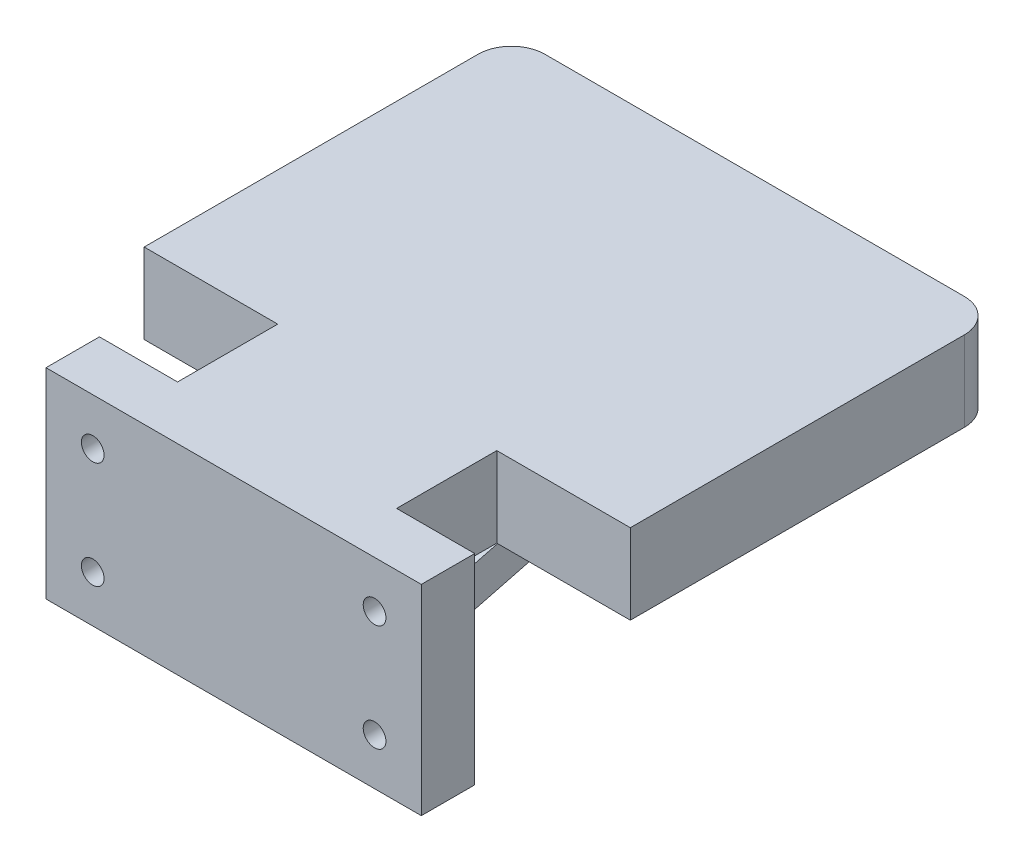
ISO-10303-21;
HEADER;
FILE_DESCRIPTION(('STEP AP214'),'2;1');
FILE_NAME('part.step','',(''),(''),'','','');
FILE_SCHEMA(('AUTOMOTIVE_DESIGN { 1 0 10303 214 1 1 1 1 }'));
ENDSEC;
DATA;
#1=APPLICATION_CONTEXT('core data for automotive mechanical design processes');
#2=APPLICATION_PROTOCOL_DEFINITION('international standard','automotive_design',2000,#1);
#3=PRODUCT_CONTEXT('',#1,'mechanical');
#4=PRODUCT('Part','Part','',(#3));
#5=PRODUCT_RELATED_PRODUCT_CATEGORY('part','',(#4));
#6=PRODUCT_DEFINITION_FORMATION('','',#4);
#7=PRODUCT_DEFINITION_CONTEXT('part definition',#1,'design');
#8=PRODUCT_DEFINITION('design','',#6,#7);
#9=PRODUCT_DEFINITION_SHAPE('','',#8);
#10=(LENGTH_UNIT() NAMED_UNIT(*) SI_UNIT(.MILLI.,.METRE.));
#11=(NAMED_UNIT(*) PLANE_ANGLE_UNIT() SI_UNIT($,.RADIAN.));
#12=(NAMED_UNIT(*) SI_UNIT($,.STERADIAN.) SOLID_ANGLE_UNIT());
#13=UNCERTAINTY_MEASURE_WITH_UNIT(LENGTH_MEASURE(1.E-05),#10,'distance_accuracy_value','');
#14=(GEOMETRIC_REPRESENTATION_CONTEXT(3) GLOBAL_UNCERTAINTY_ASSIGNED_CONTEXT((#13)) GLOBAL_UNIT_ASSIGNED_CONTEXT((#10,
#11,#12)) REPRESENTATION_CONTEXT('',''));
#15=CARTESIAN_POINT('',(0.,0.,0.));
#16=DIRECTION('',(0.,0.,1.));
#17=DIRECTION('',(1.,0.,0.));
#18=AXIS2_PLACEMENT_3D('',#15,#16,#17);
#19=CARTESIAN_POINT('',(49.1999999999998,-7.,12.8083261120685));
#20=DIRECTION('',(0.,0.,-1.));
#21=DIRECTION('',(-1.,0.,0.));
#22=AXIS2_PLACEMENT_3D('',#19,#20,#21);
#23=CYLINDRICAL_SURFACE('',#22,1.7);
#24=CARTESIAN_POINT('',(49.1999999999998,-7.,8.));
#25=DIRECTION('',(0.,0.,-1.));
#26=DIRECTION('',(-1.,0.,0.));
#27=AXIS2_PLACEMENT_3D('',#24,#25,#26);
#28=CIRCLE('',#27,1.7);
#29=CARTESIAN_POINT('',(47.4999999999998,-7.,8.));
#30=VERTEX_POINT('',#29);
#31=EDGE_CURVE('E296',#30,#30,#28,.F.);
#32=ORIENTED_EDGE('',*,*,#31,.T.);
#33=EDGE_LOOP('',(#32));
#34=FACE_BOUND('',#33,.T.);
#35=CARTESIAN_POINT('',(49.1999999999998,-7.,4.));
#36=DIRECTION('',(0.,0.,-1.));
#37=DIRECTION('',(-1.,0.,0.));
#38=AXIS2_PLACEMENT_3D('',#35,#36,#37);
#39=CIRCLE('',#38,1.7);
#40=CARTESIAN_POINT('',(47.4999999999998,-7.,4.));
#41=VERTEX_POINT('',#40);
#42=EDGE_CURVE('E38',#41,#41,#39,.F.);
#43=ORIENTED_EDGE('',*,*,#42,.F.);
#44=EDGE_LOOP('',(#43));
#45=FACE_BOUND('',#44,.T.);
#46=ADVANCED_FACE('F34',(#34,#45),#23,.F.);
#47=CARTESIAN_POINT('',(7.0000000000001,-23.0000000000001,12.8083261120685));
#48=DIRECTION('',(0.,0.,-1.));
#49=DIRECTION('',(-1.,0.,0.));
#50=AXIS2_PLACEMENT_3D('',#47,#48,#49);
#51=CYLINDRICAL_SURFACE('',#50,1.70000000000001);
#52=CARTESIAN_POINT('',(7.0000000000001,-23.0000000000001,8.));
#53=DIRECTION('',(0.,0.,-1.));
#54=DIRECTION('',(-1.,0.,0.));
#55=AXIS2_PLACEMENT_3D('',#52,#53,#54);
#56=CIRCLE('',#55,1.70000000000001);
#57=CARTESIAN_POINT('',(5.3000000000001,-23.0000000000001,8.));
#58=VERTEX_POINT('',#57);
#59=EDGE_CURVE('E297',#58,#58,#56,.F.);
#60=ORIENTED_EDGE('',*,*,#59,.T.);
#61=EDGE_LOOP('',(#60));
#62=FACE_BOUND('',#61,.T.);
#63=CARTESIAN_POINT('',(7.0000000000001,-23.0000000000001,4.));
#64=DIRECTION('',(0.,0.,-1.));
#65=DIRECTION('',(-1.,0.,0.));
#66=AXIS2_PLACEMENT_3D('',#63,#64,#65);
#67=CIRCLE('',#66,1.70000000000001);
#68=CARTESIAN_POINT('',(5.3000000000001,-23.0000000000001,4.));
#69=VERTEX_POINT('',#68);
#70=EDGE_CURVE('E340',#69,#69,#67,.F.);
#71=ORIENTED_EDGE('',*,*,#70,.F.);
#72=EDGE_LOOP('',(#71));
#73=FACE_BOUND('',#72,.T.);
#74=ADVANCED_FACE('F447',(#62,#73),#51,.F.);
#75=CARTESIAN_POINT('',(18.1,0.,0.));
#76=DIRECTION('',(1.,0.,0.));
#77=DIRECTION('',(0.,0.,-1.));
#78=AXIS2_PLACEMENT_3D('',#75,#76,#77);
#79=PLANE('',#78);
#80=DIRECTION('',(0.,1.,0.));
#81=VECTOR('',#80,1.);
#82=CARTESIAN_POINT('',(18.1,-12.,-8.));
#83=LINE('',#82,#81);
#84=CARTESIAN_POINT('',(18.1,-22.,-8.));
#85=VERTEX_POINT('',#84);
#86=CARTESIAN_POINT('',(18.1,-12.,-8.));
#87=VERTEX_POINT('',#86);
#88=EDGE_CURVE('E185',#85,#87,#83,.T.);
#89=ORIENTED_EDGE('',*,*,#88,.F.);
#90=DIRECTION('',(0.,-0.249041039810618,0.96849293259685));
#91=VECTOR('',#90,1.);
#92=CARTESIAN_POINT('',(18.1,-22.,-8.));
#93=LINE('',#92,#91);
#94=CARTESIAN_POINT('',(18.1,-12.,-46.8888888888891));
#95=VERTEX_POINT('',#94);
#96=EDGE_CURVE('E188',#95,#85,#93,.T.);
#97=ORIENTED_EDGE('',*,*,#96,.F.);
#98=DIRECTION('',(0.,0.,1.));
#99=VECTOR('',#98,1.);
#100=CARTESIAN_POINT('',(18.1,-12.,-70.));
#101=LINE('',#100,#99);
#102=CARTESIAN_POINT('',(18.1,-12.,-70.));
#103=VERTEX_POINT('',#102);
#104=EDGE_CURVE('E194',#103,#95,#101,.T.);
#105=ORIENTED_EDGE('',*,*,#104,.F.);
#106=DIRECTION('',(0.,0.249041039810618,-0.96849293259685));
#107=VECTOR('',#106,1.);
#108=CARTESIAN_POINT('',(18.1,-30.,0.));
#109=LINE('',#108,#107);
#110=CARTESIAN_POINT('',(18.1,-30.,0.));
#111=VERTEX_POINT('',#110);
#112=EDGE_CURVE('E204',#111,#103,#109,.T.);
#113=ORIENTED_EDGE('',*,*,#112,.F.);
#114=DIRECTION('',(0.,-1.,0.));
#115=VECTOR('',#114,1.);
#116=CARTESIAN_POINT('',(18.1,-12.,0.));
#117=LINE('',#116,#115);
#118=CARTESIAN_POINT('',(18.1,-12.,0.));
#119=VERTEX_POINT('',#118);
#120=EDGE_CURVE('E193',#119,#111,#117,.T.);
#121=ORIENTED_EDGE('',*,*,#120,.F.);
#122=EDGE_CURVE('E177',#87,#119,#101,.T.);
#123=ORIENTED_EDGE('',*,*,#122,.F.);
#124=EDGE_LOOP('',(#89,#97,#105,#113,#121,#123));
#125=FACE_BOUND('',#124,.T.);
#126=ADVANCED_FACE('F191',(#125),#79,.F.);
#127=CARTESIAN_POINT('',(38.1,0.,0.));
#128=DIRECTION('',(1.,0.,0.));
#129=DIRECTION('',(0.,0.,-1.));
#130=AXIS2_PLACEMENT_3D('',#127,#128,#129);
#131=PLANE('',#130);
#132=DIRECTION('',(0.,0.249041039810618,-0.96849293259685));
#133=VECTOR('',#132,1.);
#134=CARTESIAN_POINT('',(38.1,-22.,-8.));
#135=LINE('',#134,#133);
#136=CARTESIAN_POINT('',(38.1,-22.,-8.));
#137=VERTEX_POINT('',#136);
#138=CARTESIAN_POINT('',(38.1,-12.,-46.888888888889));
#139=VERTEX_POINT('',#138);
#140=EDGE_CURVE('E181',#137,#139,#135,.T.);
#141=ORIENTED_EDGE('',*,*,#140,.F.);
#142=DIRECTION('',(0.,-1.,0.));
#143=VECTOR('',#142,1.);
#144=CARTESIAN_POINT('',(38.1,-12.,-8.));
#145=LINE('',#144,#143);
#146=CARTESIAN_POINT('',(38.1,-12.,-8.));
#147=VERTEX_POINT('',#146);
#148=EDGE_CURVE('E59',#147,#137,#145,.T.);
#149=ORIENTED_EDGE('',*,*,#148,.F.);
#150=DIRECTION('',(0.,0.,1.));
#151=VECTOR('',#150,1.);
#152=CARTESIAN_POINT('',(38.1,-12.,-70.));
#153=LINE('',#152,#151);
#154=CARTESIAN_POINT('',(38.1,-12.,0.));
#155=VERTEX_POINT('',#154);
#156=EDGE_CURVE('E180',#147,#155,#153,.T.);
#157=ORIENTED_EDGE('',*,*,#156,.T.);
#158=DIRECTION('',(0.,-1.,0.));
#159=VECTOR('',#158,1.);
#160=CARTESIAN_POINT('',(38.1,-12.,0.));
#161=LINE('',#160,#159);
#162=CARTESIAN_POINT('',(38.1,-30.,0.));
#163=VERTEX_POINT('',#162);
#164=EDGE_CURVE('E199',#155,#163,#161,.T.);
#165=ORIENTED_EDGE('',*,*,#164,.T.);
#166=DIRECTION('',(0.,0.249041039810618,-0.96849293259685));
#167=VECTOR('',#166,1.);
#168=CARTESIAN_POINT('',(38.1,-30.,0.));
#169=LINE('',#168,#167);
#170=CARTESIAN_POINT('',(38.1,-12.,-70.));
#171=VERTEX_POINT('',#170);
#172=EDGE_CURVE('E195',#163,#171,#169,.T.);
#173=ORIENTED_EDGE('',*,*,#172,.T.);
#174=EDGE_CURVE('E359',#171,#139,#153,.T.);
#175=ORIENTED_EDGE('',*,*,#174,.T.);
#176=EDGE_LOOP('',(#141,#149,#157,#165,#173,#175));
#177=FACE_BOUND('',#176,.T.);
#178=ADVANCED_FACE('F366',(#177),#131,.T.);
#179=CARTESIAN_POINT('',(0.,0.,0.));
#180=DIRECTION('',(0.,0.,1.));
#181=DIRECTION('',(1.,0.,0.));
#182=AXIS2_PLACEMENT_3D('',#179,#180,#181);
#183=PLANE('',#182);
#184=CARTESIAN_POINT('',(7.00000000000003,-23.,0.));
#185=DIRECTION('',(0.,0.,-1.));
#186=DIRECTION('',(-1.,0.,0.));
#187=AXIS2_PLACEMENT_3D('',#184,#185,#186);
#188=CIRCLE('',#187,2.6);
#189=CARTESIAN_POINT('',(4.40000000000004,-23.,0.));
#190=VERTEX_POINT('',#189);
#191=EDGE_CURVE('E538',#190,#190,#188,.T.);
#192=ORIENTED_EDGE('',*,*,#191,.F.);
#193=EDGE_LOOP('',(#192));
#194=FACE_BOUND('',#193,.T.);
#195=CARTESIAN_POINT('',(7.00000000000001,-6.99999999999999,0.));
#196=DIRECTION('',(0.,0.,-1.));
#197=DIRECTION('',(1.,0.,0.));
#198=AXIS2_PLACEMENT_3D('',#195,#196,#197);
#199=CIRCLE('',#198,2.6);
#200=CARTESIAN_POINT('',(9.6,-6.99999999999999,0.));
#201=VERTEX_POINT('',#200);
#202=EDGE_CURVE('E529',#201,#201,#199,.T.);
#203=ORIENTED_EDGE('',*,*,#202,.F.);
#204=EDGE_LOOP('',(#203));
#205=FACE_BOUND('',#204,.T.);
#206=ORIENTED_EDGE('',*,*,#120,.T.);
#207=DIRECTION('',(1.,0.,0.));
#208=VECTOR('',#207,1.);
#209=CARTESIAN_POINT('',(-2.08166817117217E-13,-30.,0.));
#210=LINE('',#209,#208);
#211=CARTESIAN_POINT('',(-2.08166817117217E-13,-30.,0.));
#212=VERTEX_POINT('',#211);
#213=EDGE_CURVE('E326',#212,#111,#210,.T.);
#214=ORIENTED_EDGE('',*,*,#213,.F.);
#215=DIRECTION('',(0.,-1.,0.));
#216=VECTOR('',#215,1.);
#217=CARTESIAN_POINT('',(0.,0.,0.));
#218=LINE('',#217,#216);
#219=CARTESIAN_POINT('',(0.,0.,0.));
#220=VERTEX_POINT('',#219);
#221=EDGE_CURVE('E323',#220,#212,#218,.T.);
#222=ORIENTED_EDGE('',*,*,#221,.F.);
#223=DIRECTION('',(-1.,0.,0.));
#224=VECTOR('',#223,1.);
#225=CARTESIAN_POINT('',(0.,0.,0.));
#226=LINE('',#225,#224);
#227=CARTESIAN_POINT('',(11.7,0.,0.));
#228=VERTEX_POINT('',#227);
#229=EDGE_CURVE('E319',#228,#220,#226,.T.);
#230=ORIENTED_EDGE('',*,*,#229,.F.);
#231=DIRECTION('',(0.,1.,0.));
#232=VECTOR('',#231,1.);
#233=CARTESIAN_POINT('',(11.7,-12.,0.));
#234=LINE('',#233,#232);
#235=CARTESIAN_POINT('',(11.7,-12.,0.));
#236=VERTEX_POINT('',#235);
#237=EDGE_CURVE('E246',#236,#228,#234,.T.);
#238=ORIENTED_EDGE('',*,*,#237,.F.);
#239=DIRECTION('',(1.,0.,0.));
#240=VECTOR('',#239,1.);
#241=CARTESIAN_POINT('',(44.4999999999998,-12.,0.));
#242=LINE('',#241,#240);
#243=EDGE_CURVE('E219',#236,#119,#242,.T.);
#244=ORIENTED_EDGE('',*,*,#243,.T.);
#245=EDGE_LOOP('',(#206,#214,#222,#230,#238,#244));
#246=FACE_BOUND('',#245,.T.);
#247=ADVANCED_FACE('F414',(#194,#205,#246),#183,.F.);
#248=CARTESIAN_POINT('',(49.1999999999998,-23.,0.));
#249=DIRECTION('',(0.,0.,-1.));
#250=DIRECTION('',(1.,0.,0.));
#251=AXIS2_PLACEMENT_3D('',#248,#249,#250);
#252=CIRCLE('',#251,2.59999999999999);
#253=CARTESIAN_POINT('',(51.7999999999998,-23.,0.));
#254=VERTEX_POINT('',#253);
#255=EDGE_CURVE('E544',#254,#254,#252,.T.);
#256=ORIENTED_EDGE('',*,*,#255,.F.);
#257=EDGE_LOOP('',(#256));
#258=FACE_BOUND('',#257,.T.);
#259=CARTESIAN_POINT('',(49.1999999999998,-7.,0.));
#260=DIRECTION('',(0.,0.,-1.));
#261=DIRECTION('',(-1.,0.,0.));
#262=AXIS2_PLACEMENT_3D('',#259,#260,#261);
#263=CIRCLE('',#262,2.6);
#264=CARTESIAN_POINT('',(46.5999999999998,-7.,0.));
#265=VERTEX_POINT('',#264);
#266=EDGE_CURVE('E352',#265,#265,#263,.T.);
#267=ORIENTED_EDGE('',*,*,#266,.F.);
#268=EDGE_LOOP('',(#267));
#269=FACE_BOUND('',#268,.T.);
#270=CARTESIAN_POINT('',(56.2,-30.,0.));
#271=VERTEX_POINT('',#270);
#272=EDGE_CURVE('E325',#163,#271,#210,.T.);
#273=ORIENTED_EDGE('',*,*,#272,.F.);
#274=ORIENTED_EDGE('',*,*,#164,.F.);
#275=CARTESIAN_POINT('',(44.4999999999998,-12.,0.));
#276=VERTEX_POINT('',#275);
#277=EDGE_CURVE('E217',#155,#276,#242,.T.);
#278=ORIENTED_EDGE('',*,*,#277,.T.);
#279=DIRECTION('',(0.,1.,0.));
#280=VECTOR('',#279,1.);
#281=CARTESIAN_POINT('',(44.4999999999998,-12.,0.));
#282=LINE('',#281,#280);
#283=CARTESIAN_POINT('',(44.4999999999998,0.,0.));
#284=VERTEX_POINT('',#283);
#285=EDGE_CURVE('E289',#276,#284,#282,.T.);
#286=ORIENTED_EDGE('',*,*,#285,.T.);
#287=CARTESIAN_POINT('',(56.1999999999998,0.,0.));
#288=VERTEX_POINT('',#287);
#289=EDGE_CURVE('E320',#288,#284,#226,.T.);
#290=ORIENTED_EDGE('',*,*,#289,.F.);
#291=DIRECTION('',(0.,1.,0.));
#292=VECTOR('',#291,1.);
#293=CARTESIAN_POINT('',(56.1999999999998,0.,0.));
#294=LINE('',#293,#292);
#295=EDGE_CURVE('E316',#271,#288,#294,.T.);
#296=ORIENTED_EDGE('',*,*,#295,.F.);
#297=EDGE_LOOP('',(#273,#274,#278,#286,#290,#296));
#298=FACE_BOUND('',#297,.T.);
#299=ADVANCED_FACE('F403',(#258,#269,#298),#183,.F.);
#300=CARTESIAN_POINT('',(56.1999999999998,0.,5.));
#301=DIRECTION('',(-1.,0.,0.));
#302=DIRECTION('',(0.,-1.,0.));
#303=AXIS2_PLACEMENT_3D('',#300,#301,#302);
#304=PLANE('',#303);
#305=ORIENTED_EDGE('',*,*,#295,.T.);
#306=DIRECTION('',(0.,0.,-1.));
#307=VECTOR('',#306,1.);
#308=CARTESIAN_POINT('',(56.1999999999998,0.,5.));
#309=LINE('',#308,#307);
#310=CARTESIAN_POINT('',(56.1999999999998,0.,8.));
#311=VERTEX_POINT('',#310);
#312=EDGE_CURVE('E11',#311,#288,#309,.T.);
#313=ORIENTED_EDGE('',*,*,#312,.F.);
#314=DIRECTION('',(0.,1.,0.));
#315=VECTOR('',#314,1.);
#316=CARTESIAN_POINT('',(56.1999999999998,0.,8.));
#317=LINE('',#316,#315);
#318=CARTESIAN_POINT('',(56.2,-29.9999999999996,8.));
#319=VERTEX_POINT('',#318);
#320=EDGE_CURVE('E313',#319,#311,#317,.T.);
#321=ORIENTED_EDGE('',*,*,#320,.F.);
#322=DIRECTION('',(0.,0.,-1.));
#323=VECTOR('',#322,1.);
#324=CARTESIAN_POINT('',(56.2,-30.,5.));
#325=LINE('',#324,#323);
#326=EDGE_CURVE('E329',#319,#271,#325,.T.);
#327=ORIENTED_EDGE('',*,*,#326,.T.);
#328=EDGE_LOOP('',(#305,#313,#321,#327));
#329=FACE_BOUND('',#328,.T.);
#330=ADVANCED_FACE('F36',(#329),#304,.F.);
#331=CARTESIAN_POINT('',(0.,0.,5.));
#332=DIRECTION('',(0.,-1.,0.));
#333=DIRECTION('',(1.,0.,0.));
#334=AXIS2_PLACEMENT_3D('',#331,#332,#333);
#335=PLANE('',#334);
#336=ORIENTED_EDGE('',*,*,#289,.T.);
#337=DIRECTION('',(0.,0.,-1.));
#338=VECTOR('',#337,1.);
#339=CARTESIAN_POINT('',(44.4999999999998,0.,0.));
#340=LINE('',#339,#338);
#341=CARTESIAN_POINT('',(44.4999999999998,0.,-15.));
#342=VERTEX_POINT('',#341);
#343=EDGE_CURVE('E249',#284,#342,#340,.T.);
#344=ORIENTED_EDGE('',*,*,#343,.T.);
#345=DIRECTION('',(1.,0.,0.));
#346=VECTOR('',#345,1.);
#347=CARTESIAN_POINT('',(44.4999999999998,0.,-15.));
#348=LINE('',#347,#346);
#349=CARTESIAN_POINT('',(64.4999999999998,0.,-15.));
#350=VERTEX_POINT('',#349);
#351=EDGE_CURVE('E252',#342,#350,#348,.T.);
#352=ORIENTED_EDGE('',*,*,#351,.T.);
#353=DIRECTION('',(0.,0.,-1.));
#354=VECTOR('',#353,1.);
#355=CARTESIAN_POINT('',(64.4999999999998,0.,-15.));
#356=LINE('',#355,#354);
#357=CARTESIAN_POINT('',(64.4999999999998,0.,-65.));
#358=VERTEX_POINT('',#357);
#359=EDGE_CURVE('E255',#350,#358,#356,.T.);
#360=ORIENTED_EDGE('',*,*,#359,.T.);
#361=CARTESIAN_POINT('',(59.4999999999998,0.,-65.));
#362=DIRECTION('',(0.,1.,0.));
#363=DIRECTION('',(0.,0.,1.));
#364=AXIS2_PLACEMENT_3D('',#361,#362,#363);
#365=CIRCLE('',#364,5.);
#366=CARTESIAN_POINT('',(59.4999999999998,0.,-70.));
#367=VERTEX_POINT('',#366);
#368=EDGE_CURVE('E258',#358,#367,#365,.T.);
#369=ORIENTED_EDGE('',*,*,#368,.T.);
#370=DIRECTION('',(-1.,0.,0.));
#371=VECTOR('',#370,1.);
#372=CARTESIAN_POINT('',(-3.3,0.,-70.));
#373=LINE('',#372,#371);
#374=CARTESIAN_POINT('',(-3.3,0.,-70.));
#375=VERTEX_POINT('',#374);
#376=EDGE_CURVE('E261',#367,#375,#373,.T.);
#377=ORIENTED_EDGE('',*,*,#376,.T.);
#378=CARTESIAN_POINT('',(-3.3,0.,-65.));
#379=DIRECTION('',(0.,1.,0.));
#380=DIRECTION('',(0.,0.,-1.));
#381=AXIS2_PLACEMENT_3D('',#378,#379,#380);
#382=CIRCLE('',#381,5.);
#383=CARTESIAN_POINT('',(-8.3,0.,-65.));
#384=VERTEX_POINT('',#383);
#385=EDGE_CURVE('E264',#375,#384,#382,.T.);
#386=ORIENTED_EDGE('',*,*,#385,.T.);
#387=DIRECTION('',(0.,0.,1.));
#388=VECTOR('',#387,1.);
#389=CARTESIAN_POINT('',(-8.3,0.,-15.));
#390=LINE('',#389,#388);
#391=CARTESIAN_POINT('',(-8.3,0.,-15.));
#392=VERTEX_POINT('',#391);
#393=EDGE_CURVE('E267',#384,#392,#390,.T.);
#394=ORIENTED_EDGE('',*,*,#393,.T.);
#395=DIRECTION('',(1.,0.,0.));
#396=VECTOR('',#395,1.);
#397=CARTESIAN_POINT('',(11.7,0.,-15.));
#398=LINE('',#397,#396);
#399=CARTESIAN_POINT('',(11.7,0.,-15.));
#400=VERTEX_POINT('',#399);
#401=EDGE_CURVE('E218',#392,#400,#398,.T.);
#402=ORIENTED_EDGE('',*,*,#401,.T.);
#403=DIRECTION('',(0.,0.,1.));
#404=VECTOR('',#403,1.);
#405=CARTESIAN_POINT('',(11.7,0.,0.));
#406=LINE('',#405,#404);
#407=EDGE_CURVE('E211',#400,#228,#406,.T.);
#408=ORIENTED_EDGE('',*,*,#407,.T.);
#409=ORIENTED_EDGE('',*,*,#229,.T.);
#410=DIRECTION('',(0.,0.,-1.));
#411=VECTOR('',#410,1.);
#412=CARTESIAN_POINT('',(0.,0.,5.));
#413=LINE('',#412,#411);
#414=CARTESIAN_POINT('',(0.,0.,8.));
#415=VERTEX_POINT('',#414);
#416=EDGE_CURVE('E43',#415,#220,#413,.T.);
#417=ORIENTED_EDGE('',*,*,#416,.F.);
#418=DIRECTION('',(-1.,0.,0.));
#419=VECTOR('',#418,1.);
#420=CARTESIAN_POINT('',(0.,0.,8.));
#421=LINE('',#420,#419);
#422=EDGE_CURVE('E304',#311,#415,#421,.T.);
#423=ORIENTED_EDGE('',*,*,#422,.F.);
#424=ORIENTED_EDGE('',*,*,#312,.T.);
#425=EDGE_LOOP('',(#336,#344,#352,#360,#369,#377,#386,#394,#402,#408,#409,#417,#423,#424));
#426=FACE_BOUND('',#425,.T.);
#427=ADVANCED_FACE('F387',(#426),#335,.F.);
#428=CARTESIAN_POINT('',(0.,0.,5.));
#429=DIRECTION('',(1.,0.,0.));
#430=DIRECTION('',(0.,1.,0.));
#431=AXIS2_PLACEMENT_3D('',#428,#429,#430);
#432=PLANE('',#431);
#433=ORIENTED_EDGE('',*,*,#221,.T.);
#434=DIRECTION('',(0.,0.,-1.));
#435=VECTOR('',#434,1.);
#436=CARTESIAN_POINT('',(-2.08166817117217E-13,-30.,5.));
#437=LINE('',#436,#435);
#438=CARTESIAN_POINT('',(-2.08166817117217E-13,-30.,8.));
#439=VERTEX_POINT('',#438);
#440=EDGE_CURVE('E332',#439,#212,#437,.T.);
#441=ORIENTED_EDGE('',*,*,#440,.F.);
#442=DIRECTION('',(0.,-1.,0.));
#443=VECTOR('',#442,1.);
#444=CARTESIAN_POINT('',(0.,0.,8.));
#445=LINE('',#444,#443);
#446=EDGE_CURVE('E307',#415,#439,#445,.T.);
#447=ORIENTED_EDGE('',*,*,#446,.F.);
#448=ORIENTED_EDGE('',*,*,#416,.T.);
#449=EDGE_LOOP('',(#433,#441,#447,#448));
#450=FACE_BOUND('',#449,.T.);
#451=ADVANCED_FACE('F428',(#450),#432,.F.);
#452=CARTESIAN_POINT('',(-2.08166817117217E-13,-30.,5.));
#453=DIRECTION('',(0.,1.,0.));
#454=DIRECTION('',(-1.,0.,0.));
#455=AXIS2_PLACEMENT_3D('',#452,#453,#454);
#456=PLANE('',#455);
#457=ORIENTED_EDGE('',*,*,#213,.T.);
#458=DIRECTION('',(1.,0.,0.));
#459=VECTOR('',#458,1.);
#460=CARTESIAN_POINT('',(18.1,-30.,0.));
#461=LINE('',#460,#459);
#462=EDGE_CURVE('E207',#111,#163,#461,.T.);
#463=ORIENTED_EDGE('',*,*,#462,.T.);
#464=ORIENTED_EDGE('',*,*,#272,.T.);
#465=ORIENTED_EDGE('',*,*,#326,.F.);
#466=DIRECTION('',(1.,0.,0.));
#467=VECTOR('',#466,1.);
#468=CARTESIAN_POINT('',(-2.08166817117217E-13,-30.,8.));
#469=LINE('',#468,#467);
#470=EDGE_CURVE('E310',#439,#319,#469,.T.);
#471=ORIENTED_EDGE('',*,*,#470,.F.);
#472=ORIENTED_EDGE('',*,*,#440,.T.);
#473=EDGE_LOOP('',(#457,#463,#464,#465,#471,#472));
#474=FACE_BOUND('',#473,.T.);
#475=ADVANCED_FACE('F409',(#474),#456,.F.);
#476=CARTESIAN_POINT('',(0.,0.,8.));
#477=DIRECTION('',(0.,0.,-1.));
#478=DIRECTION('',(-1.,0.,0.));
#479=AXIS2_PLACEMENT_3D('',#476,#477,#478);
#480=PLANE('',#479);
#481=CARTESIAN_POINT('',(7.00000000000008,-6.99999999999992,8.));
#482=DIRECTION('',(0.,0.,-1.));
#483=DIRECTION('',(-1.,0.,0.));
#484=AXIS2_PLACEMENT_3D('',#481,#482,#483);
#485=CIRCLE('',#484,1.7);
#486=CARTESIAN_POINT('',(5.30000000000007,-6.99999999999992,8.));
#487=VERTEX_POINT('',#486);
#488=EDGE_CURVE('E293',#487,#487,#485,.F.);
#489=ORIENTED_EDGE('',*,*,#488,.F.);
#490=EDGE_LOOP('',(#489));
#491=FACE_BOUND('',#490,.T.);
#492=ORIENTED_EDGE('',*,*,#59,.F.);
#493=EDGE_LOOP('',(#492));
#494=FACE_BOUND('',#493,.T.);
#495=CARTESIAN_POINT('',(49.1999999999998,-23.,8.));
#496=DIRECTION('',(0.,0.,-1.));
#497=DIRECTION('',(-1.,0.,0.));
#498=AXIS2_PLACEMENT_3D('',#495,#496,#497);
#499=CIRCLE('',#498,1.69999999999999);
#500=CARTESIAN_POINT('',(47.4999999999998,-23.,8.));
#501=VERTEX_POINT('',#500);
#502=EDGE_CURVE('E274',#501,#501,#499,.F.);
#503=ORIENTED_EDGE('',*,*,#502,.F.);
#504=EDGE_LOOP('',(#503));
#505=FACE_BOUND('',#504,.T.);
#506=ORIENTED_EDGE('',*,*,#31,.F.);
#507=EDGE_LOOP('',(#506));
#508=FACE_BOUND('',#507,.T.);
#509=ORIENTED_EDGE('',*,*,#422,.T.);
#510=ORIENTED_EDGE('',*,*,#446,.T.);
#511=ORIENTED_EDGE('',*,*,#470,.T.);
#512=ORIENTED_EDGE('',*,*,#320,.T.);
#513=EDGE_LOOP('',(#509,#510,#511,#512));
#514=FACE_BOUND('',#513,.T.);
#515=ADVANCED_FACE('F430',(#491,#494,#505,#508,#514),#480,.F.);
#516=CARTESIAN_POINT('',(49.1999999999998,-23.,12.8083261120685));
#517=DIRECTION('',(0.,0.,-1.));
#518=DIRECTION('',(-1.,0.,0.));
#519=AXIS2_PLACEMENT_3D('',#516,#517,#518);
#520=CYLINDRICAL_SURFACE('',#519,1.69999999999999);
#521=CARTESIAN_POINT('',(49.1999999999998,-23.,4.));
#522=DIRECTION('',(0.,0.,1.));
#523=DIRECTION('',(1.,0.,0.));
#524=AXIS2_PLACEMENT_3D('',#521,#522,#523);
#525=CIRCLE('',#524,1.69999999999999);
#526=CARTESIAN_POINT('',(50.8999999999998,-23.,4.));
#527=VERTEX_POINT('',#526);
#528=EDGE_CURVE('E343',#527,#527,#525,.F.);
#529=ORIENTED_EDGE('',*,*,#528,.T.);
#530=EDGE_LOOP('',(#529));
#531=FACE_BOUND('',#530,.T.);
#532=ORIENTED_EDGE('',*,*,#502,.T.);
#533=EDGE_LOOP('',(#532));
#534=FACE_BOUND('',#533,.T.);
#535=ADVANCED_FACE('F432',(#531,#534),#520,.F.);
#536=CARTESIAN_POINT('',(7.00000000000008,-6.99999999999992,12.8083261120685));
#537=DIRECTION('',(0.,0.,-1.));
#538=DIRECTION('',(-1.,0.,0.));
#539=AXIS2_PLACEMENT_3D('',#536,#537,#538);
#540=CYLINDRICAL_SURFACE('',#539,1.7);
#541=CARTESIAN_POINT('',(7.00000000000008,-6.99999999999992,4.));
#542=DIRECTION('',(0.,0.,1.));
#543=DIRECTION('',(1.,0.,0.));
#544=AXIS2_PLACEMENT_3D('',#541,#542,#543);
#545=CIRCLE('',#544,1.7);
#546=CARTESIAN_POINT('',(8.70000000000008,-6.99999999999992,4.));
#547=VERTEX_POINT('',#546);
#548=EDGE_CURVE('E337',#547,#547,#545,.F.);
#549=ORIENTED_EDGE('',*,*,#548,.T.);
#550=EDGE_LOOP('',(#549));
#551=FACE_BOUND('',#550,.T.);
#552=ORIENTED_EDGE('',*,*,#488,.T.);
#553=EDGE_LOOP('',(#552));
#554=FACE_BOUND('',#553,.T.);
#555=ADVANCED_FACE('F439',(#551,#554),#540,.F.);
#556=CARTESIAN_POINT('',(11.7,-12.,0.));
#557=DIRECTION('',(-1.,0.,0.));
#558=DIRECTION('',(0.,0.,1.));
#559=AXIS2_PLACEMENT_3D('',#556,#557,#558);
#560=PLANE('',#559);
#561=ORIENTED_EDGE('',*,*,#407,.F.);
#562=DIRECTION('',(0.,1.,0.));
#563=VECTOR('',#562,1.);
#564=CARTESIAN_POINT('',(11.7,-12.,-15.));
#565=LINE('',#564,#563);
#566=CARTESIAN_POINT('',(11.7,-12.,-15.));
#567=VERTEX_POINT('',#566);
#568=EDGE_CURVE('E272',#567,#400,#565,.T.);
#569=ORIENTED_EDGE('',*,*,#568,.F.);
#570=DIRECTION('',(0.,0.,1.));
#571=VECTOR('',#570,1.);
#572=CARTESIAN_POINT('',(11.7,-12.,0.));
#573=LINE('',#572,#571);
#574=EDGE_CURVE('E214',#567,#236,#573,.T.);
#575=ORIENTED_EDGE('',*,*,#574,.T.);
#576=ORIENTED_EDGE('',*,*,#237,.T.);
#577=EDGE_LOOP('',(#561,#569,#575,#576));
#578=FACE_BOUND('',#577,.T.);
#579=ADVANCED_FACE('F420',(#578),#560,.T.);
#580=CARTESIAN_POINT('',(11.7,-12.,-15.));
#581=DIRECTION('',(0.,0.,1.));
#582=DIRECTION('',(1.,0.,0.));
#583=AXIS2_PLACEMENT_3D('',#580,#581,#582);
#584=PLANE('',#583);
#585=ORIENTED_EDGE('',*,*,#401,.F.);
#586=DIRECTION('',(0.,1.,0.));
#587=VECTOR('',#586,1.);
#588=CARTESIAN_POINT('',(-8.3,-12.,-15.));
#589=LINE('',#588,#587);
#590=CARTESIAN_POINT('',(-8.3,-12.,-15.));
#591=VERTEX_POINT('',#590);
#592=EDGE_CURVE('E275',#591,#392,#589,.T.);
#593=ORIENTED_EDGE('',*,*,#592,.F.);
#594=DIRECTION('',(1.,0.,0.));
#595=VECTOR('',#594,1.);
#596=CARTESIAN_POINT('',(11.7,-12.,-15.));
#597=LINE('',#596,#595);
#598=EDGE_CURVE('E243',#591,#567,#597,.T.);
#599=ORIENTED_EDGE('',*,*,#598,.T.);
#600=ORIENTED_EDGE('',*,*,#568,.T.);
#601=EDGE_LOOP('',(#585,#593,#599,#600));
#602=FACE_BOUND('',#601,.T.);
#603=ADVANCED_FACE('F423',(#602),#584,.T.);
#604=CARTESIAN_POINT('',(-8.3,-12.,-15.));
#605=DIRECTION('',(-1.,0.,0.));
#606=DIRECTION('',(0.,0.,1.));
#607=AXIS2_PLACEMENT_3D('',#604,#605,#606);
#608=PLANE('',#607);
#609=ORIENTED_EDGE('',*,*,#393,.F.);
#610=DIRECTION('',(0.,1.,0.));
#611=VECTOR('',#610,1.);
#612=CARTESIAN_POINT('',(-8.3,-12.,-65.));
#613=LINE('',#612,#611);
#614=CARTESIAN_POINT('',(-8.3,-12.,-65.));
#615=VERTEX_POINT('',#614);
#616=EDGE_CURVE('E277',#615,#384,#613,.T.);
#617=ORIENTED_EDGE('',*,*,#616,.F.);
#618=DIRECTION('',(0.,0.,1.));
#619=VECTOR('',#618,1.);
#620=CARTESIAN_POINT('',(-8.3,-12.,-15.));
#621=LINE('',#620,#619);
#622=EDGE_CURVE('E240',#615,#591,#621,.T.);
#623=ORIENTED_EDGE('',*,*,#622,.T.);
#624=ORIENTED_EDGE('',*,*,#592,.T.);
#625=EDGE_LOOP('',(#609,#617,#623,#624));
#626=FACE_BOUND('',#625,.T.);
#627=ADVANCED_FACE('F425',(#626),#608,.T.);
#628=CARTESIAN_POINT('',(-3.3,-12.,-65.));
#629=DIRECTION('',(0.,1.,0.));
#630=DIRECTION('',(0.,0.,1.));
#631=AXIS2_PLACEMENT_3D('',#628,#629,#630);
#632=CYLINDRICAL_SURFACE('',#631,5.);
#633=ORIENTED_EDGE('',*,*,#385,.F.);
#634=DIRECTION('',(0.,1.,0.));
#635=VECTOR('',#634,1.);
#636=CARTESIAN_POINT('',(-3.3,-12.,-70.));
#637=LINE('',#636,#635);
#638=CARTESIAN_POINT('',(-3.3,-12.,-70.));
#639=VERTEX_POINT('',#638);
#640=EDGE_CURVE('E279',#639,#375,#637,.T.);
#641=ORIENTED_EDGE('',*,*,#640,.F.);
#642=CARTESIAN_POINT('',(-3.3,-12.,-65.));
#643=DIRECTION('',(0.,1.,0.));
#644=DIRECTION('',(0.,0.,-1.));
#645=AXIS2_PLACEMENT_3D('',#642,#643,#644);
#646=CIRCLE('',#645,5.);
#647=EDGE_CURVE('E237',#639,#615,#646,.T.);
#648=ORIENTED_EDGE('',*,*,#647,.T.);
#649=ORIENTED_EDGE('',*,*,#616,.T.);
#650=EDGE_LOOP('',(#633,#641,#648,#649));
#651=FACE_BOUND('',#650,.T.);
#652=ADVANCED_FACE('F383',(#651),#632,.T.);
#653=CARTESIAN_POINT('',(-3.3,-12.,-70.));
#654=DIRECTION('',(0.,0.,-1.));
#655=DIRECTION('',(-1.,0.,0.));
#656=AXIS2_PLACEMENT_3D('',#653,#654,#655);
#657=PLANE('',#656);
#658=ORIENTED_EDGE('',*,*,#376,.F.);
#659=DIRECTION('',(0.,1.,0.));
#660=VECTOR('',#659,1.);
#661=CARTESIAN_POINT('',(59.4999999999998,-12.,-70.));
#662=LINE('',#661,#660);
#663=CARTESIAN_POINT('',(59.4999999999998,-12.,-70.));
#664=VERTEX_POINT('',#663);
#665=EDGE_CURVE('E281',#664,#367,#662,.T.);
#666=ORIENTED_EDGE('',*,*,#665,.F.);
#667=DIRECTION('',(-1.,0.,0.));
#668=VECTOR('',#667,1.);
#669=CARTESIAN_POINT('',(-3.3,-12.,-70.));
#670=LINE('',#669,#668);
#671=EDGE_CURVE('E234',#664,#171,#670,.T.);
#672=ORIENTED_EDGE('',*,*,#671,.T.);
#673=DIRECTION('',(1.,0.,0.));
#674=VECTOR('',#673,1.);
#675=CARTESIAN_POINT('',(18.1,-12.,-70.));
#676=LINE('',#675,#674);
#677=EDGE_CURVE('E208',#103,#171,#676,.T.);
#678=ORIENTED_EDGE('',*,*,#677,.F.);
#679=EDGE_CURVE('E233',#103,#639,#670,.T.);
#680=ORIENTED_EDGE('',*,*,#679,.T.);
#681=ORIENTED_EDGE('',*,*,#640,.T.);
#682=EDGE_LOOP('',(#658,#666,#672,#678,#680,#681));
#683=FACE_BOUND('',#682,.T.);
#684=ADVANCED_FACE('F375',(#683),#657,.T.);
#685=CARTESIAN_POINT('',(59.4999999999998,-12.,-65.));
#686=DIRECTION('',(0.,1.,0.));
#687=DIRECTION('',(0.,0.,1.));
#688=AXIS2_PLACEMENT_3D('',#685,#686,#687);
#689=CYLINDRICAL_SURFACE('',#688,5.);
#690=ORIENTED_EDGE('',*,*,#368,.F.);
#691=DIRECTION('',(0.,1.,0.));
#692=VECTOR('',#691,1.);
#693=CARTESIAN_POINT('',(64.4999999999998,-12.,-65.));
#694=LINE('',#693,#692);
#695=CARTESIAN_POINT('',(64.4999999999998,-12.,-65.));
#696=VERTEX_POINT('',#695);
#697=EDGE_CURVE('E283',#696,#358,#694,.T.);
#698=ORIENTED_EDGE('',*,*,#697,.F.);
#699=CARTESIAN_POINT('',(59.4999999999998,-12.,-65.));
#700=DIRECTION('',(0.,1.,0.));
#701=DIRECTION('',(0.,0.,1.));
#702=AXIS2_PLACEMENT_3D('',#699,#700,#701);
#703=CIRCLE('',#702,5.);
#704=EDGE_CURVE('E230',#696,#664,#703,.T.);
#705=ORIENTED_EDGE('',*,*,#704,.T.);
#706=ORIENTED_EDGE('',*,*,#665,.T.);
#707=EDGE_LOOP('',(#690,#698,#705,#706));
#708=FACE_BOUND('',#707,.T.);
#709=ADVANCED_FACE('F390',(#708),#689,.T.);
#710=CARTESIAN_POINT('',(64.4999999999998,-12.,-15.));
#711=DIRECTION('',(1.,0.,0.));
#712=DIRECTION('',(0.,0.,-1.));
#713=AXIS2_PLACEMENT_3D('',#710,#711,#712);
#714=PLANE('',#713);
#715=ORIENTED_EDGE('',*,*,#359,.F.);
#716=DIRECTION('',(0.,1.,0.));
#717=VECTOR('',#716,1.);
#718=CARTESIAN_POINT('',(64.4999999999998,-12.,-15.));
#719=LINE('',#718,#717);
#720=CARTESIAN_POINT('',(64.4999999999998,-12.,-15.));
#721=VERTEX_POINT('',#720);
#722=EDGE_CURVE('E285',#721,#350,#719,.T.);
#723=ORIENTED_EDGE('',*,*,#722,.F.);
#724=DIRECTION('',(0.,0.,-1.));
#725=VECTOR('',#724,1.);
#726=CARTESIAN_POINT('',(64.4999999999998,-12.,-15.));
#727=LINE('',#726,#725);
#728=EDGE_CURVE('E227',#721,#696,#727,.T.);
#729=ORIENTED_EDGE('',*,*,#728,.T.);
#730=ORIENTED_EDGE('',*,*,#697,.T.);
#731=EDGE_LOOP('',(#715,#723,#729,#730));
#732=FACE_BOUND('',#731,.T.);
#733=ADVANCED_FACE('F395',(#732),#714,.T.);
#734=CARTESIAN_POINT('',(44.4999999999998,-12.,-15.));
#735=DIRECTION('',(0.,0.,1.));
#736=DIRECTION('',(1.,0.,0.));
#737=AXIS2_PLACEMENT_3D('',#734,#735,#736);
#738=PLANE('',#737);
#739=ORIENTED_EDGE('',*,*,#351,.F.);
#740=DIRECTION('',(0.,1.,0.));
#741=VECTOR('',#740,1.);
#742=CARTESIAN_POINT('',(44.4999999999998,-12.,-15.));
#743=LINE('',#742,#741);
#744=CARTESIAN_POINT('',(44.4999999999998,-12.,-15.));
#745=VERTEX_POINT('',#744);
#746=EDGE_CURVE('E287',#745,#342,#743,.T.);
#747=ORIENTED_EDGE('',*,*,#746,.F.);
#748=DIRECTION('',(1.,0.,0.));
#749=VECTOR('',#748,1.);
#750=CARTESIAN_POINT('',(44.4999999999998,-12.,-15.));
#751=LINE('',#750,#749);
#752=EDGE_CURVE('E224',#745,#721,#751,.T.);
#753=ORIENTED_EDGE('',*,*,#752,.T.);
#754=ORIENTED_EDGE('',*,*,#722,.T.);
#755=EDGE_LOOP('',(#739,#747,#753,#754));
#756=FACE_BOUND('',#755,.T.);
#757=ADVANCED_FACE('F398',(#756),#738,.T.);
#758=CARTESIAN_POINT('',(44.4999999999998,-12.,0.));
#759=DIRECTION('',(1.,0.,0.));
#760=DIRECTION('',(0.,0.,-1.));
#761=AXIS2_PLACEMENT_3D('',#758,#759,#760);
#762=PLANE('',#761);
#763=ORIENTED_EDGE('',*,*,#343,.F.);
#764=ORIENTED_EDGE('',*,*,#285,.F.);
#765=DIRECTION('',(0.,0.,-1.));
#766=VECTOR('',#765,1.);
#767=CARTESIAN_POINT('',(44.4999999999998,-12.,0.));
#768=LINE('',#767,#766);
#769=EDGE_CURVE('E221',#276,#745,#768,.T.);
#770=ORIENTED_EDGE('',*,*,#769,.T.);
#771=ORIENTED_EDGE('',*,*,#746,.T.);
#772=EDGE_LOOP('',(#763,#764,#770,#771));
#773=FACE_BOUND('',#772,.T.);
#774=ADVANCED_FACE('F402',(#773),#762,.T.);
#775=CARTESIAN_POINT('',(-3.3,-12.,-65.));
#776=DIRECTION('',(0.,-1.,0.));
#777=DIRECTION('',(0.,0.,-1.));
#778=AXIS2_PLACEMENT_3D('',#775,#776,#777);
#779=PLANE('',#778);
#780=ORIENTED_EDGE('',*,*,#174,.F.);
#781=ORIENTED_EDGE('',*,*,#671,.F.);
#782=ORIENTED_EDGE('',*,*,#704,.F.);
#783=ORIENTED_EDGE('',*,*,#728,.F.);
#784=ORIENTED_EDGE('',*,*,#752,.F.);
#785=ORIENTED_EDGE('',*,*,#769,.F.);
#786=ORIENTED_EDGE('',*,*,#277,.F.);
#787=ORIENTED_EDGE('',*,*,#156,.F.);
#788=DIRECTION('',(-1.,0.,0.));
#789=VECTOR('',#788,1.);
#790=CARTESIAN_POINT('',(64.5009999999998,-12.,-8.));
#791=LINE('',#790,#789);
#792=EDGE_CURVE('E173',#147,#87,#791,.T.);
#793=ORIENTED_EDGE('',*,*,#792,.T.);
#794=ORIENTED_EDGE('',*,*,#122,.T.);
#795=ORIENTED_EDGE('',*,*,#243,.F.);
#796=ORIENTED_EDGE('',*,*,#574,.F.);
#797=ORIENTED_EDGE('',*,*,#598,.F.);
#798=ORIENTED_EDGE('',*,*,#622,.F.);
#799=ORIENTED_EDGE('',*,*,#647,.F.);
#800=ORIENTED_EDGE('',*,*,#679,.F.);
#801=ORIENTED_EDGE('',*,*,#104,.T.);
#802=DIRECTION('',(-1.,0.,0.));
#803=VECTOR('',#802,1.);
#804=CARTESIAN_POINT('',(64.5009999999998,-12.,-46.8888888888889));
#805=LINE('',#804,#803);
#806=EDGE_CURVE('E51',#139,#95,#805,.T.);
#807=ORIENTED_EDGE('',*,*,#806,.F.);
#808=EDGE_LOOP('',(#780,#781,#782,#783,#784,#785,#786,#787,#793,#794,#795,#796,#797,#798,#799,
#800,#801,#807));
#809=FACE_BOUND('',#808,.T.);
#810=ADVANCED_FACE('F175',(#809),#779,.T.);
#811=CARTESIAN_POINT('',(18.1,-30.,0.));
#812=DIRECTION('',(0.,-0.96849293259685,-0.249041039810618));
#813=DIRECTION('',(0.,0.249041039810618,-0.96849293259685));
#814=AXIS2_PLACEMENT_3D('',#811,#812,#813);
#815=PLANE('',#814);
#816=ORIENTED_EDGE('',*,*,#677,.T.);
#817=ORIENTED_EDGE('',*,*,#172,.F.);
#818=ORIENTED_EDGE('',*,*,#462,.F.);
#819=ORIENTED_EDGE('',*,*,#112,.T.);
#820=EDGE_LOOP('',(#816,#817,#818,#819));
#821=FACE_BOUND('',#820,.T.);
#822=ADVANCED_FACE('F370',(#821),#815,.T.);
#823=CARTESIAN_POINT('',(64.5009999999998,-12.,-8.));
#824=DIRECTION('',(0.,0.,-1.));
#825=DIRECTION('',(0.,1.,0.));
#826=AXIS2_PLACEMENT_3D('',#823,#824,#825);
#827=PLANE('',#826);
#828=ORIENTED_EDGE('',*,*,#148,.T.);
#829=DIRECTION('',(-1.,0.,0.));
#830=VECTOR('',#829,1.);
#831=CARTESIAN_POINT('',(64.5009999999998,-22.,-8.));
#832=LINE('',#831,#830);
#833=EDGE_CURVE('E182',#137,#85,#832,.T.);
#834=ORIENTED_EDGE('',*,*,#833,.T.);
#835=ORIENTED_EDGE('',*,*,#88,.T.);
#836=ORIENTED_EDGE('',*,*,#792,.F.);
#837=EDGE_LOOP('',(#828,#834,#835,#836));
#838=FACE_BOUND('',#837,.T.);
#839=ADVANCED_FACE('F186',(#838),#827,.T.);
#840=CARTESIAN_POINT('',(64.5009999999998,-22.,-8.));
#841=DIRECTION('',(0.,0.96849293259685,0.249041039810618));
#842=DIRECTION('',(0.,-0.249041039810618,0.96849293259685));
#843=AXIS2_PLACEMENT_3D('',#840,#841,#842);
#844=PLANE('',#843);
#845=ORIENTED_EDGE('',*,*,#140,.T.);
#846=ORIENTED_EDGE('',*,*,#806,.T.);
#847=ORIENTED_EDGE('',*,*,#96,.T.);
#848=ORIENTED_EDGE('',*,*,#833,.F.);
#849=EDGE_LOOP('',(#845,#846,#847,#848));
#850=FACE_BOUND('',#849,.T.);
#851=ADVANCED_FACE('F487',(#850),#844,.T.);
#852=CARTESIAN_POINT('',(7.00000000000001,-6.99999999999999,4.));
#853=DIRECTION('',(0.,0.,1.));
#854=DIRECTION('',(1.,0.,0.));
#855=AXIS2_PLACEMENT_3D('',#852,#853,#854);
#856=PLANE('',#855);
#857=CARTESIAN_POINT('',(7.00000000000001,-6.99999999999999,4.));
#858=DIRECTION('',(0.,0.,-1.));
#859=DIRECTION('',(1.,0.,0.));
#860=AXIS2_PLACEMENT_3D('',#857,#858,#859);
#861=CIRCLE('',#860,2.6);
#862=CARTESIAN_POINT('',(9.6,-6.99999999999999,4.));
#863=VERTEX_POINT('',#862);
#864=EDGE_CURVE('E526',#863,#863,#861,.T.);
#865=ORIENTED_EDGE('',*,*,#864,.T.);
#866=EDGE_LOOP('',(#865));
#867=FACE_BOUND('',#866,.T.);
#868=ORIENTED_EDGE('',*,*,#548,.F.);
#869=EDGE_LOOP('',(#868));
#870=FACE_BOUND('',#869,.T.);
#871=ADVANCED_FACE('F490',(#867,#870),#856,.F.);
#872=CARTESIAN_POINT('',(7.00000000000001,-6.99999999999999,4.));
#873=DIRECTION('',(0.,0.,-1.));
#874=DIRECTION('',(-1.,0.,0.));
#875=AXIS2_PLACEMENT_3D('',#872,#873,#874);
#876=CYLINDRICAL_SURFACE('',#875,2.6);
#877=ORIENTED_EDGE('',*,*,#864,.F.);
#878=EDGE_LOOP('',(#877));
#879=FACE_BOUND('',#878,.T.);
#880=ORIENTED_EDGE('',*,*,#202,.T.);
#881=EDGE_LOOP('',(#880));
#882=FACE_BOUND('',#881,.T.);
#883=ADVANCED_FACE('F514',(#879,#882),#876,.F.);
#884=CARTESIAN_POINT('',(7.00000000000003,-23.,4.));
#885=DIRECTION('',(0.,0.,-1.));
#886=DIRECTION('',(-1.,0.,0.));
#887=AXIS2_PLACEMENT_3D('',#884,#885,#886);
#888=PLANE('',#887);
#889=CARTESIAN_POINT('',(7.00000000000003,-23.,4.));
#890=DIRECTION('',(0.,0.,-1.));
#891=DIRECTION('',(-1.,0.,0.));
#892=AXIS2_PLACEMENT_3D('',#889,#890,#891);
#893=CIRCLE('',#892,2.6);
#894=CARTESIAN_POINT('',(4.40000000000004,-23.,4.));
#895=VERTEX_POINT('',#894);
#896=EDGE_CURVE('E533',#895,#895,#893,.T.);
#897=ORIENTED_EDGE('',*,*,#896,.T.);
#898=EDGE_LOOP('',(#897));
#899=FACE_BOUND('',#898,.T.);
#900=ORIENTED_EDGE('',*,*,#70,.T.);
#901=EDGE_LOOP('',(#900));
#902=FACE_BOUND('',#901,.T.);
#903=ADVANCED_FACE('F510',(#899,#902),#888,.T.);
#904=CARTESIAN_POINT('',(7.00000000000003,-23.,4.));
#905=DIRECTION('',(0.,0.,-1.));
#906=DIRECTION('',(-1.,0.,0.));
#907=AXIS2_PLACEMENT_3D('',#904,#905,#906);
#908=CYLINDRICAL_SURFACE('',#907,2.6);
#909=ORIENTED_EDGE('',*,*,#896,.F.);
#910=EDGE_LOOP('',(#909));
#911=FACE_BOUND('',#910,.T.);
#912=ORIENTED_EDGE('',*,*,#191,.T.);
#913=EDGE_LOOP('',(#912));
#914=FACE_BOUND('',#913,.T.);
#915=ADVANCED_FACE('F506',(#911,#914),#908,.F.);
#916=CARTESIAN_POINT('',(49.1999999999998,-23.,4.));
#917=DIRECTION('',(0.,0.,1.));
#918=DIRECTION('',(1.,0.,0.));
#919=AXIS2_PLACEMENT_3D('',#916,#917,#918);
#920=PLANE('',#919);
#921=CARTESIAN_POINT('',(49.1999999999998,-23.,4.));
#922=DIRECTION('',(0.,0.,-1.));
#923=DIRECTION('',(1.,0.,0.));
#924=AXIS2_PLACEMENT_3D('',#921,#922,#923);
#925=CIRCLE('',#924,2.59999999999999);
#926=CARTESIAN_POINT('',(51.7999999999998,-23.,4.));
#927=VERTEX_POINT('',#926);
#928=EDGE_CURVE('E541',#927,#927,#925,.T.);
#929=ORIENTED_EDGE('',*,*,#928,.T.);
#930=EDGE_LOOP('',(#929));
#931=FACE_BOUND('',#930,.T.);
#932=ORIENTED_EDGE('',*,*,#528,.F.);
#933=EDGE_LOOP('',(#932));
#934=FACE_BOUND('',#933,.T.);
#935=ADVANCED_FACE('F502',(#931,#934),#920,.F.);
#936=CARTESIAN_POINT('',(49.1999999999998,-23.,4.));
#937=DIRECTION('',(0.,0.,-1.));
#938=DIRECTION('',(-1.,0.,0.));
#939=AXIS2_PLACEMENT_3D('',#936,#937,#938);
#940=CYLINDRICAL_SURFACE('',#939,2.59999999999999);
#941=ORIENTED_EDGE('',*,*,#928,.F.);
#942=EDGE_LOOP('',(#941));
#943=FACE_BOUND('',#942,.T.);
#944=ORIENTED_EDGE('',*,*,#255,.T.);
#945=EDGE_LOOP('',(#944));
#946=FACE_BOUND('',#945,.T.);
#947=ADVANCED_FACE('F498',(#943,#946),#940,.F.);
#948=CARTESIAN_POINT('',(49.1999999999998,-7.,4.));
#949=DIRECTION('',(0.,0.,-1.));
#950=DIRECTION('',(-1.,0.,0.));
#951=AXIS2_PLACEMENT_3D('',#948,#949,#950);
#952=PLANE('',#951);
#953=CARTESIAN_POINT('',(49.1999999999998,-7.,4.));
#954=DIRECTION('',(0.,0.,-1.));
#955=DIRECTION('',(-1.,0.,0.));
#956=AXIS2_PLACEMENT_3D('',#953,#954,#955);
#957=CIRCLE('',#956,2.6);
#958=CARTESIAN_POINT('',(46.5999999999998,-7.,4.));
#959=VERTEX_POINT('',#958);
#960=EDGE_CURVE('E341',#959,#959,#957,.T.);
#961=ORIENTED_EDGE('',*,*,#960,.T.);
#962=EDGE_LOOP('',(#961));
#963=FACE_BOUND('',#962,.T.);
#964=ORIENTED_EDGE('',*,*,#42,.T.);
#965=EDGE_LOOP('',(#964));
#966=FACE_BOUND('',#965,.T.);
#967=ADVANCED_FACE('F494',(#963,#966),#952,.T.);
#968=CARTESIAN_POINT('',(49.1999999999998,-7.,4.));
#969=DIRECTION('',(0.,0.,-1.));
#970=DIRECTION('',(-1.,0.,0.));
#971=AXIS2_PLACEMENT_3D('',#968,#969,#970);
#972=CYLINDRICAL_SURFACE('',#971,2.6);
#973=ORIENTED_EDGE('',*,*,#960,.F.);
#974=EDGE_LOOP('',(#973));
#975=FACE_BOUND('',#974,.T.);
#976=ORIENTED_EDGE('',*,*,#266,.T.);
#977=EDGE_LOOP('',(#976));
#978=FACE_BOUND('',#977,.T.);
#979=ADVANCED_FACE('F491',(#975,#978),#972,.F.);
#980=CLOSED_SHELL('',(#46,#74,#126,#178,#247,#299,#330,#427,#451,#475,#515,#535,#555,#579,#603,
#627,#652,#684,#709,#733,#757,#774,#810,#822,#839,#851,#871,#883,#903,#915,#935,#947,#967,#979));
#981=MANIFOLD_SOLID_BREP('B2',#980);
#982=ADVANCED_BREP_SHAPE_REPRESENTATION('',(#18,#981),#14);
#983=SHAPE_DEFINITION_REPRESENTATION(#9,#982);
ENDSEC;
END-ISO-10303-21;
